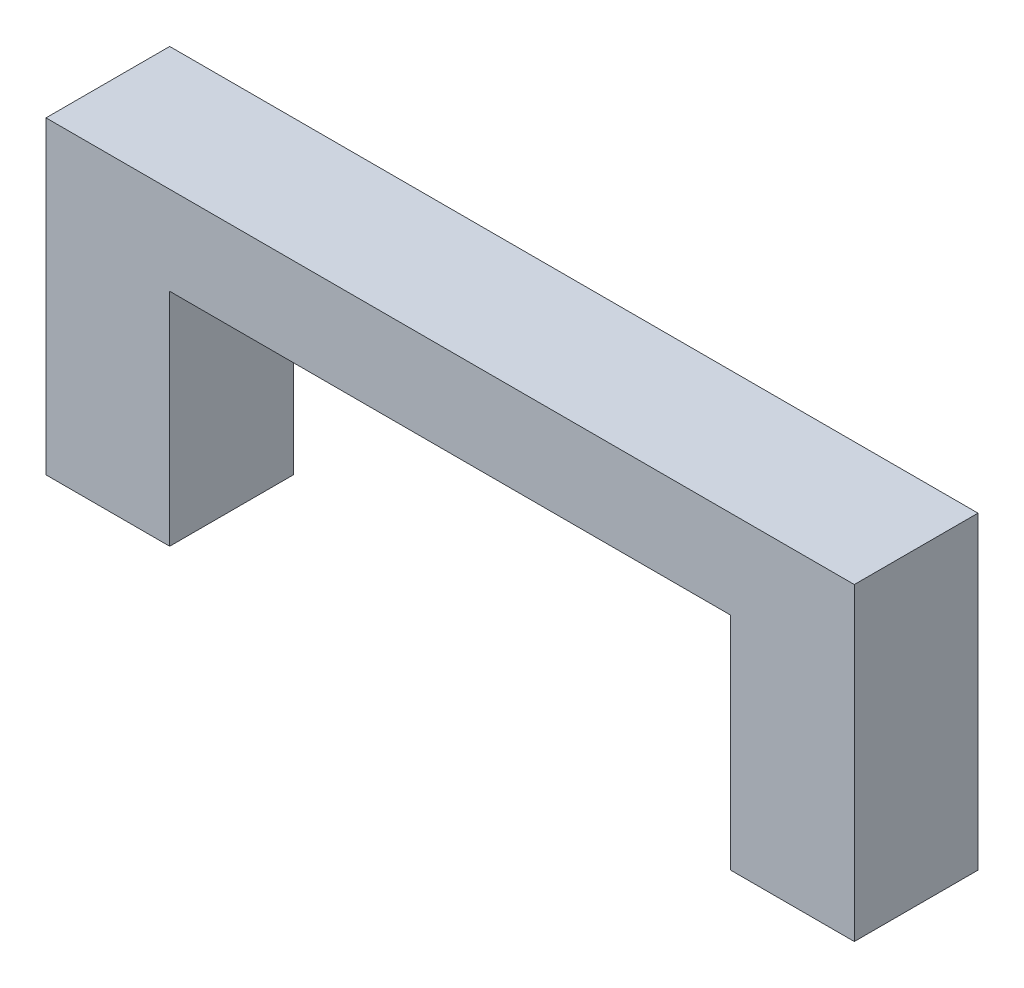
ISO-10303-21;
HEADER;
FILE_DESCRIPTION(('STEP AP214'),'2;1');
FILE_NAME('part.step','',(''),(''),'','','');
FILE_SCHEMA(('AUTOMOTIVE_DESIGN { 1 0 10303 214 1 1 1 1 }'));
ENDSEC;
DATA;
#1=APPLICATION_CONTEXT('core data for automotive mechanical design processes');
#2=APPLICATION_PROTOCOL_DEFINITION('international standard','automotive_design',2000,#1);
#3=PRODUCT_CONTEXT('',#1,'mechanical');
#4=PRODUCT('Part','Part','',(#3));
#5=PRODUCT_RELATED_PRODUCT_CATEGORY('part','',(#4));
#6=PRODUCT_DEFINITION_FORMATION('','',#4);
#7=PRODUCT_DEFINITION_CONTEXT('part definition',#1,'design');
#8=PRODUCT_DEFINITION('design','',#6,#7);
#9=PRODUCT_DEFINITION_SHAPE('','',#8);
#10=(LENGTH_UNIT() NAMED_UNIT(*) SI_UNIT(.MILLI.,.METRE.));
#11=(NAMED_UNIT(*) PLANE_ANGLE_UNIT() SI_UNIT($,.RADIAN.));
#12=(NAMED_UNIT(*) SI_UNIT($,.STERADIAN.) SOLID_ANGLE_UNIT());
#13=UNCERTAINTY_MEASURE_WITH_UNIT(LENGTH_MEASURE(1.E-05),#10,'distance_accuracy_value','');
#14=(GEOMETRIC_REPRESENTATION_CONTEXT(3) GLOBAL_UNCERTAINTY_ASSIGNED_CONTEXT((#13)) GLOBAL_UNIT_ASSIGNED_CONTEXT((#10,
#11,#12)) REPRESENTATION_CONTEXT('',''));
#15=CARTESIAN_POINT('',(0.,0.,0.));
#16=DIRECTION('',(0.,0.,1.));
#17=DIRECTION('',(1.,0.,0.));
#18=AXIS2_PLACEMENT_3D('',#15,#16,#17);
#19=CARTESIAN_POINT('',(18.3,0.,2.8));
#20=DIRECTION('',(0.,1.,0.));
#21=DIRECTION('',(-1.,0.,0.));
#22=AXIS2_PLACEMENT_3D('',#19,#20,#21);
#23=PLANE('',#22);
#24=DIRECTION('',(1.,0.,0.));
#25=VECTOR('',#24,1.);
#26=CARTESIAN_POINT('',(18.3,0.,0.));
#27=LINE('',#26,#25);
#28=CARTESIAN_POINT('',(15.5,0.,0.));
#29=VERTEX_POINT('',#28);
#30=CARTESIAN_POINT('',(18.3,0.,0.));
#31=VERTEX_POINT('',#30);
#32=EDGE_CURVE('E236',#29,#31,#27,.T.);
#33=ORIENTED_EDGE('',*,*,#32,.T.);
#34=DIRECTION('',(0.,0.,-1.));
#35=VECTOR('',#34,1.);
#36=CARTESIAN_POINT('',(18.3,0.,2.8));
#37=LINE('',#36,#35);
#38=CARTESIAN_POINT('',(18.3,0.,2.8));
#39=VERTEX_POINT('',#38);
#40=EDGE_CURVE('E251',#39,#31,#37,.T.);
#41=ORIENTED_EDGE('',*,*,#40,.F.);
#42=DIRECTION('',(1.,0.,0.));
#43=VECTOR('',#42,1.);
#44=CARTESIAN_POINT('',(18.3,0.,2.8));
#45=LINE('',#44,#43);
#46=CARTESIAN_POINT('',(15.5,0.,2.8));
#47=VERTEX_POINT('',#46);
#48=EDGE_CURVE('E219',#47,#39,#45,.T.);
#49=ORIENTED_EDGE('',*,*,#48,.F.);
#50=DIRECTION('',(0.,0.,-1.));
#51=VECTOR('',#50,1.);
#52=CARTESIAN_POINT('',(15.5,0.,2.8));
#53=LINE('',#52,#51);
#54=EDGE_CURVE('E254',#47,#29,#53,.T.);
#55=ORIENTED_EDGE('',*,*,#54,.T.);
#56=EDGE_LOOP('',(#33,#41,#49,#55));
#57=FACE_BOUND('',#56,.T.);
#58=DIRECTION('',(0.,0.,-1.));
#59=VECTOR('',#58,1.);
#60=CARTESIAN_POINT('',(17.9,0.,0.));
#61=LINE('',#60,#59);
#62=CARTESIAN_POINT('',(17.9,0.,2.4));
#63=VERTEX_POINT('',#62);
#64=CARTESIAN_POINT('',(17.9,0.,0.4));
#65=VERTEX_POINT('',#64);
#66=EDGE_CURVE('E56',#63,#65,#61,.T.);
#67=ORIENTED_EDGE('',*,*,#66,.T.);
#68=DIRECTION('',(1.,0.,0.));
#69=VECTOR('',#68,1.);
#70=CARTESIAN_POINT('',(0.,0.,0.4));
#71=LINE('',#70,#69);
#72=CARTESIAN_POINT('',(15.9,0.,0.4));
#73=VERTEX_POINT('',#72);
#74=EDGE_CURVE('E185',#73,#65,#71,.T.);
#75=ORIENTED_EDGE('',*,*,#74,.F.);
#76=DIRECTION('',(0.,0.,-1.));
#77=VECTOR('',#76,1.);
#78=CARTESIAN_POINT('',(15.9,0.,0.));
#79=LINE('',#78,#77);
#80=CARTESIAN_POINT('',(15.9,0.,2.4));
#81=VERTEX_POINT('',#80);
#82=EDGE_CURVE('E196',#81,#73,#79,.T.);
#83=ORIENTED_EDGE('',*,*,#82,.F.);
#84=DIRECTION('',(1.,0.,0.));
#85=VECTOR('',#84,1.);
#86=CARTESIAN_POINT('',(0.,0.,2.4));
#87=LINE('',#86,#85);
#88=EDGE_CURVE('E168',#81,#63,#87,.T.);
#89=ORIENTED_EDGE('',*,*,#88,.T.);
#90=EDGE_LOOP('',(#67,#75,#83,#89));
#91=FACE_BOUND('',#90,.T.);
#92=ADVANCED_FACE('F33',(#57,#91),#23,.F.);
#93=CARTESIAN_POINT('',(2.8,0.,2.8));
#94=DIRECTION('',(0.,1.,0.));
#95=DIRECTION('',(-1.,0.,0.));
#96=AXIS2_PLACEMENT_3D('',#93,#94,#95);
#97=PLANE('',#96);
#98=DIRECTION('',(1.,0.,0.));
#99=VECTOR('',#98,1.);
#100=CARTESIAN_POINT('',(0.4,0.,0.4));
#101=LINE('',#100,#99);
#102=CARTESIAN_POINT('',(0.4,0.,0.4));
#103=VERTEX_POINT('',#102);
#104=CARTESIAN_POINT('',(2.4,0.,0.4));
#105=VERTEX_POINT('',#104);
#106=EDGE_CURVE('E166',#103,#105,#101,.T.);
#107=ORIENTED_EDGE('',*,*,#106,.F.);
#108=DIRECTION('',(0.,0.,-1.));
#109=VECTOR('',#108,1.);
#110=CARTESIAN_POINT('',(0.4,0.,2.4));
#111=LINE('',#110,#109);
#112=CARTESIAN_POINT('',(0.4,0.,2.4));
#113=VERTEX_POINT('',#112);
#114=EDGE_CURVE('E48',#113,#103,#111,.T.);
#115=ORIENTED_EDGE('',*,*,#114,.F.);
#116=DIRECTION('',(1.,0.,0.));
#117=VECTOR('',#116,1.);
#118=CARTESIAN_POINT('',(0.4,0.,2.4));
#119=LINE('',#118,#117);
#120=CARTESIAN_POINT('',(2.4,0.,2.4));
#121=VERTEX_POINT('',#120);
#122=EDGE_CURVE('E155',#113,#121,#119,.T.);
#123=ORIENTED_EDGE('',*,*,#122,.T.);
#124=DIRECTION('',(0.,0.,-1.));
#125=VECTOR('',#124,1.);
#126=CARTESIAN_POINT('',(2.4,0.,2.4));
#127=LINE('',#126,#125);
#128=EDGE_CURVE('E161',#121,#105,#127,.T.);
#129=ORIENTED_EDGE('',*,*,#128,.T.);
#130=EDGE_LOOP('',(#107,#115,#123,#129));
#131=FACE_BOUND('',#130,.T.);
#132=DIRECTION('',(1.,0.,0.));
#133=VECTOR('',#132,1.);
#134=CARTESIAN_POINT('',(2.8,0.,0.));
#135=LINE('',#134,#133);
#136=CARTESIAN_POINT('',(0.,0.,0.));
#137=VERTEX_POINT('',#136);
#138=CARTESIAN_POINT('',(2.8,0.,0.));
#139=VERTEX_POINT('',#138);
#140=EDGE_CURVE('E203',#137,#139,#135,.T.);
#141=ORIENTED_EDGE('',*,*,#140,.T.);
#142=DIRECTION('',(0.,0.,-1.));
#143=VECTOR('',#142,1.);
#144=CARTESIAN_POINT('',(2.8,0.,2.8));
#145=LINE('',#144,#143);
#146=CARTESIAN_POINT('',(2.8,0.,2.8));
#147=VERTEX_POINT('',#146);
#148=EDGE_CURVE('E11',#147,#139,#145,.T.);
#149=ORIENTED_EDGE('',*,*,#148,.F.);
#150=DIRECTION('',(1.,0.,0.));
#151=VECTOR('',#150,1.);
#152=CARTESIAN_POINT('',(2.8,0.,2.8));
#153=LINE('',#152,#151);
#154=CARTESIAN_POINT('',(0.,0.,2.8));
#155=VERTEX_POINT('',#154);
#156=EDGE_CURVE('E209',#155,#147,#153,.T.);
#157=ORIENTED_EDGE('',*,*,#156,.F.);
#158=DIRECTION('',(0.,0.,-1.));
#159=VECTOR('',#158,1.);
#160=CARTESIAN_POINT('',(0.,0.,2.8));
#161=LINE('',#160,#159);
#162=EDGE_CURVE('E227',#155,#137,#161,.T.);
#163=ORIENTED_EDGE('',*,*,#162,.T.);
#164=EDGE_LOOP('',(#141,#149,#157,#163));
#165=FACE_BOUND('',#164,.T.);
#166=ADVANCED_FACE('F35',(#131,#165),#97,.F.);
#167=CARTESIAN_POINT('',(2.8,5.,2.8));
#168=DIRECTION('',(-1.,0.,0.));
#169=DIRECTION('',(0.,-1.,0.));
#170=AXIS2_PLACEMENT_3D('',#167,#168,#169);
#171=PLANE('',#170);
#172=DIRECTION('',(0.,1.,0.));
#173=VECTOR('',#172,1.);
#174=CARTESIAN_POINT('',(2.8,5.,0.));
#175=LINE('',#174,#173);
#176=CARTESIAN_POINT('',(2.8,5.,0.));
#177=VERTEX_POINT('',#176);
#178=EDGE_CURVE('E230',#139,#177,#175,.T.);
#179=ORIENTED_EDGE('',*,*,#178,.T.);
#180=DIRECTION('',(0.,0.,-1.));
#181=VECTOR('',#180,1.);
#182=CARTESIAN_POINT('',(2.8,5.,2.8));
#183=LINE('',#182,#181);
#184=CARTESIAN_POINT('',(2.8,5.,2.8));
#185=VERTEX_POINT('',#184);
#186=EDGE_CURVE('E41',#185,#177,#183,.T.);
#187=ORIENTED_EDGE('',*,*,#186,.F.);
#188=DIRECTION('',(0.,1.,0.));
#189=VECTOR('',#188,1.);
#190=CARTESIAN_POINT('',(2.8,5.,2.8));
#191=LINE('',#190,#189);
#192=EDGE_CURVE('E212',#147,#185,#191,.T.);
#193=ORIENTED_EDGE('',*,*,#192,.F.);
#194=ORIENTED_EDGE('',*,*,#148,.T.);
#195=EDGE_LOOP('',(#179,#187,#193,#194));
#196=FACE_BOUND('',#195,.T.);
#197=ADVANCED_FACE('F287',(#196),#171,.F.);
#198=CARTESIAN_POINT('',(15.5,5.,2.8));
#199=DIRECTION('',(0.,1.,0.));
#200=DIRECTION('',(-1.,0.,0.));
#201=AXIS2_PLACEMENT_3D('',#198,#199,#200);
#202=PLANE('',#201);
#203=DIRECTION('',(1.,0.,0.));
#204=VECTOR('',#203,1.);
#205=CARTESIAN_POINT('',(15.5,5.,0.));
#206=LINE('',#205,#204);
#207=CARTESIAN_POINT('',(15.5,5.,0.));
#208=VERTEX_POINT('',#207);
#209=EDGE_CURVE('E232',#177,#208,#206,.T.);
#210=ORIENTED_EDGE('',*,*,#209,.T.);
#211=DIRECTION('',(0.,0.,-1.));
#212=VECTOR('',#211,1.);
#213=CARTESIAN_POINT('',(15.5,5.,2.8));
#214=LINE('',#213,#212);
#215=CARTESIAN_POINT('',(15.5,5.,2.8));
#216=VERTEX_POINT('',#215);
#217=EDGE_CURVE('E257',#216,#208,#214,.T.);
#218=ORIENTED_EDGE('',*,*,#217,.F.);
#219=DIRECTION('',(1.,0.,0.));
#220=VECTOR('',#219,1.);
#221=CARTESIAN_POINT('',(15.5,5.,2.8));
#222=LINE('',#221,#220);
#223=EDGE_CURVE('E215',#185,#216,#222,.T.);
#224=ORIENTED_EDGE('',*,*,#223,.F.);
#225=ORIENTED_EDGE('',*,*,#186,.T.);
#226=EDGE_LOOP('',(#210,#218,#224,#225));
#227=FACE_BOUND('',#226,.T.);
#228=ADVANCED_FACE('F264',(#227),#202,.F.);
#229=CARTESIAN_POINT('',(15.5,0.,2.8));
#230=DIRECTION('',(1.,0.,0.));
#231=DIRECTION('',(0.,0.,-1.));
#232=AXIS2_PLACEMENT_3D('',#229,#230,#231);
#233=PLANE('',#232);
#234=DIRECTION('',(0.,-1.,0.));
#235=VECTOR('',#234,1.);
#236=CARTESIAN_POINT('',(15.5,0.,0.));
#237=LINE('',#236,#235);
#238=EDGE_CURVE('E234',#208,#29,#237,.T.);
#239=ORIENTED_EDGE('',*,*,#238,.T.);
#240=ORIENTED_EDGE('',*,*,#54,.F.);
#241=DIRECTION('',(0.,-1.,0.));
#242=VECTOR('',#241,1.);
#243=CARTESIAN_POINT('',(15.5,0.,2.8));
#244=LINE('',#243,#242);
#245=EDGE_CURVE('E217',#216,#47,#244,.T.);
#246=ORIENTED_EDGE('',*,*,#245,.F.);
#247=ORIENTED_EDGE('',*,*,#217,.T.);
#248=EDGE_LOOP('',(#239,#240,#246,#247));
#249=FACE_BOUND('',#248,.T.);
#250=ADVANCED_FACE('F275',(#249),#233,.F.);
#251=CARTESIAN_POINT('',(18.3,7.,2.8));
#252=DIRECTION('',(-1.,0.,0.));
#253=DIRECTION('',(0.,0.,1.));
#254=AXIS2_PLACEMENT_3D('',#251,#252,#253);
#255=PLANE('',#254);
#256=DIRECTION('',(0.,1.,0.));
#257=VECTOR('',#256,1.);
#258=CARTESIAN_POINT('',(18.3,7.,0.));
#259=LINE('',#258,#257);
#260=CARTESIAN_POINT('',(18.3,7.,0.));
#261=VERTEX_POINT('',#260);
#262=EDGE_CURVE('E238',#31,#261,#259,.T.);
#263=ORIENTED_EDGE('',*,*,#262,.T.);
#264=DIRECTION('',(0.,0.,-1.));
#265=VECTOR('',#264,1.);
#266=CARTESIAN_POINT('',(18.3,7.,2.8));
#267=LINE('',#266,#265);
#268=CARTESIAN_POINT('',(18.3,7.,2.8));
#269=VERTEX_POINT('',#268);
#270=EDGE_CURVE('E248',#269,#261,#267,.T.);
#271=ORIENTED_EDGE('',*,*,#270,.F.);
#272=DIRECTION('',(0.,1.,0.));
#273=VECTOR('',#272,1.);
#274=CARTESIAN_POINT('',(18.3,7.,2.8));
#275=LINE('',#274,#273);
#276=EDGE_CURVE('E221',#39,#269,#275,.T.);
#277=ORIENTED_EDGE('',*,*,#276,.F.);
#278=ORIENTED_EDGE('',*,*,#40,.T.);
#279=EDGE_LOOP('',(#263,#271,#277,#278));
#280=FACE_BOUND('',#279,.T.);
#281=ADVANCED_FACE('F299',(#280),#255,.F.);
#282=CARTESIAN_POINT('',(0.,7.,2.8));
#283=DIRECTION('',(0.,-1.,0.));
#284=DIRECTION('',(0.,0.,-1.));
#285=AXIS2_PLACEMENT_3D('',#282,#283,#284);
#286=PLANE('',#285);
#287=DIRECTION('',(-1.,0.,0.));
#288=VECTOR('',#287,1.);
#289=CARTESIAN_POINT('',(0.,7.,0.));
#290=LINE('',#289,#288);
#291=CARTESIAN_POINT('',(0.,7.,0.));
#292=VERTEX_POINT('',#291);
#293=EDGE_CURVE('E240',#261,#292,#290,.T.);
#294=ORIENTED_EDGE('',*,*,#293,.T.);
#295=DIRECTION('',(0.,0.,-1.));
#296=VECTOR('',#295,1.);
#297=CARTESIAN_POINT('',(0.,7.,2.8));
#298=LINE('',#297,#296);
#299=CARTESIAN_POINT('',(0.,7.,2.8));
#300=VERTEX_POINT('',#299);
#301=EDGE_CURVE('E245',#300,#292,#298,.T.);
#302=ORIENTED_EDGE('',*,*,#301,.F.);
#303=DIRECTION('',(-1.,0.,0.));
#304=VECTOR('',#303,1.);
#305=CARTESIAN_POINT('',(0.,7.,2.8));
#306=LINE('',#305,#304);
#307=EDGE_CURVE('E223',#269,#300,#306,.T.);
#308=ORIENTED_EDGE('',*,*,#307,.F.);
#309=ORIENTED_EDGE('',*,*,#270,.T.);
#310=EDGE_LOOP('',(#294,#302,#308,#309));
#311=FACE_BOUND('',#310,.T.);
#312=ADVANCED_FACE('F297',(#311),#286,.F.);
#313=CARTESIAN_POINT('',(0.,0.,2.8));
#314=DIRECTION('',(1.,0.,0.));
#315=DIRECTION('',(0.,0.,-1.));
#316=AXIS2_PLACEMENT_3D('',#313,#314,#315);
#317=PLANE('',#316);
#318=DIRECTION('',(0.,-1.,0.));
#319=VECTOR('',#318,1.);
#320=CARTESIAN_POINT('',(0.,0.,0.));
#321=LINE('',#320,#319);
#322=EDGE_CURVE('E213',#292,#137,#321,.T.);
#323=ORIENTED_EDGE('',*,*,#322,.T.);
#324=ORIENTED_EDGE('',*,*,#162,.F.);
#325=DIRECTION('',(0.,-1.,0.));
#326=VECTOR('',#325,1.);
#327=CARTESIAN_POINT('',(0.,0.,2.8));
#328=LINE('',#327,#326);
#329=EDGE_CURVE('E225',#300,#155,#328,.T.);
#330=ORIENTED_EDGE('',*,*,#329,.F.);
#331=ORIENTED_EDGE('',*,*,#301,.T.);
#332=EDGE_LOOP('',(#323,#324,#330,#331));
#333=FACE_BOUND('',#332,.T.);
#334=ADVANCED_FACE('F292',(#333),#317,.F.);
#335=CARTESIAN_POINT('',(0.,0.,2.8));
#336=DIRECTION('',(0.,0.,-1.));
#337=DIRECTION('',(-1.,0.,0.));
#338=AXIS2_PLACEMENT_3D('',#335,#336,#337);
#339=PLANE('',#338);
#340=ORIENTED_EDGE('',*,*,#156,.T.);
#341=ORIENTED_EDGE('',*,*,#192,.T.);
#342=ORIENTED_EDGE('',*,*,#223,.T.);
#343=ORIENTED_EDGE('',*,*,#245,.T.);
#344=ORIENTED_EDGE('',*,*,#48,.T.);
#345=ORIENTED_EDGE('',*,*,#276,.T.);
#346=ORIENTED_EDGE('',*,*,#307,.T.);
#347=ORIENTED_EDGE('',*,*,#329,.T.);
#348=EDGE_LOOP('',(#340,#341,#342,#343,#344,#345,#346,#347));
#349=FACE_BOUND('',#348,.T.);
#350=ADVANCED_FACE('F283',(#349),#339,.F.);
#351=CARTESIAN_POINT('',(0.,0.,0.));
#352=DIRECTION('',(0.,0.,-1.));
#353=DIRECTION('',(-1.,0.,0.));
#354=AXIS2_PLACEMENT_3D('',#351,#352,#353);
#355=PLANE('',#354);
#356=ORIENTED_EDGE('',*,*,#140,.F.);
#357=ORIENTED_EDGE('',*,*,#322,.F.);
#358=ORIENTED_EDGE('',*,*,#293,.F.);
#359=ORIENTED_EDGE('',*,*,#262,.F.);
#360=ORIENTED_EDGE('',*,*,#32,.F.);
#361=ORIENTED_EDGE('',*,*,#238,.F.);
#362=ORIENTED_EDGE('',*,*,#209,.F.);
#363=ORIENTED_EDGE('',*,*,#178,.F.);
#364=EDGE_LOOP('',(#356,#357,#358,#359,#360,#361,#362,#363));
#365=FACE_BOUND('',#364,.T.);
#366=ADVANCED_FACE('F270',(#365),#355,.T.);
#367=CARTESIAN_POINT('',(17.9,2.2,0.));
#368=DIRECTION('',(-1.,0.,0.));
#369=DIRECTION('',(0.,0.,1.));
#370=AXIS2_PLACEMENT_3D('',#367,#368,#369);
#371=PLANE('',#370);
#372=ORIENTED_EDGE('',*,*,#66,.F.);
#373=DIRECTION('',(0.,-1.,0.));
#374=VECTOR('',#373,1.);
#375=CARTESIAN_POINT('',(17.9,2.2,2.4));
#376=LINE('',#375,#374);
#377=CARTESIAN_POINT('',(17.9,2.2,2.4));
#378=VERTEX_POINT('',#377);
#379=EDGE_CURVE('E192',#378,#63,#376,.T.);
#380=ORIENTED_EDGE('',*,*,#379,.F.);
#381=DIRECTION('',(0.,0.,-1.));
#382=VECTOR('',#381,1.);
#383=CARTESIAN_POINT('',(17.9,2.2,0.));
#384=LINE('',#383,#382);
#385=CARTESIAN_POINT('',(17.9,2.2,0.4));
#386=VERTEX_POINT('',#385);
#387=EDGE_CURVE('E182',#378,#386,#384,.T.);
#388=ORIENTED_EDGE('',*,*,#387,.T.);
#389=DIRECTION('',(0.,-1.,0.));
#390=VECTOR('',#389,1.);
#391=CARTESIAN_POINT('',(17.9,2.2,0.4));
#392=LINE('',#391,#390);
#393=EDGE_CURVE('E201',#386,#65,#392,.T.);
#394=ORIENTED_EDGE('',*,*,#393,.T.);
#395=EDGE_LOOP('',(#372,#380,#388,#394));
#396=FACE_BOUND('',#395,.T.);
#397=ADVANCED_FACE('F362',(#396),#371,.T.);
#398=CARTESIAN_POINT('',(0.,2.2,0.4));
#399=DIRECTION('',(0.,0.,-1.));
#400=DIRECTION('',(-1.,0.,0.));
#401=AXIS2_PLACEMENT_3D('',#398,#399,#400);
#402=PLANE('',#401);
#403=ORIENTED_EDGE('',*,*,#74,.T.);
#404=ORIENTED_EDGE('',*,*,#393,.F.);
#405=DIRECTION('',(1.,0.,0.));
#406=VECTOR('',#405,1.);
#407=CARTESIAN_POINT('',(0.,2.2,0.4));
#408=LINE('',#407,#406);
#409=CARTESIAN_POINT('',(15.9,2.2,0.4));
#410=VERTEX_POINT('',#409);
#411=EDGE_CURVE('E190',#410,#386,#408,.T.);
#412=ORIENTED_EDGE('',*,*,#411,.F.);
#413=DIRECTION('',(0.,-1.,0.));
#414=VECTOR('',#413,1.);
#415=CARTESIAN_POINT('',(15.9,2.2,0.4));
#416=LINE('',#415,#414);
#417=EDGE_CURVE('E204',#410,#73,#416,.T.);
#418=ORIENTED_EDGE('',*,*,#417,.T.);
#419=EDGE_LOOP('',(#403,#404,#412,#418));
#420=FACE_BOUND('',#419,.T.);
#421=ADVANCED_FACE('F380',(#420),#402,.F.);
#422=CARTESIAN_POINT('',(15.9,2.2,0.));
#423=DIRECTION('',(-1.,0.,0.));
#424=DIRECTION('',(0.,0.,1.));
#425=AXIS2_PLACEMENT_3D('',#422,#423,#424);
#426=PLANE('',#425);
#427=ORIENTED_EDGE('',*,*,#82,.T.);
#428=ORIENTED_EDGE('',*,*,#417,.F.);
#429=DIRECTION('',(0.,0.,-1.));
#430=VECTOR('',#429,1.);
#431=CARTESIAN_POINT('',(15.9,2.2,0.));
#432=LINE('',#431,#430);
#433=CARTESIAN_POINT('',(15.9,2.2,2.4));
#434=VERTEX_POINT('',#433);
#435=EDGE_CURVE('E187',#434,#410,#432,.T.);
#436=ORIENTED_EDGE('',*,*,#435,.F.);
#437=DIRECTION('',(0.,-1.,0.));
#438=VECTOR('',#437,1.);
#439=CARTESIAN_POINT('',(15.9,2.2,2.4));
#440=LINE('',#439,#438);
#441=EDGE_CURVE('E206',#434,#81,#440,.T.);
#442=ORIENTED_EDGE('',*,*,#441,.T.);
#443=EDGE_LOOP('',(#427,#428,#436,#442));
#444=FACE_BOUND('',#443,.T.);
#445=ADVANCED_FACE('F389',(#444),#426,.F.);
#446=CARTESIAN_POINT('',(0.,2.2,2.4));
#447=DIRECTION('',(0.,0.,-1.));
#448=DIRECTION('',(-1.,0.,0.));
#449=AXIS2_PLACEMENT_3D('',#446,#447,#448);
#450=PLANE('',#449);
#451=ORIENTED_EDGE('',*,*,#88,.F.);
#452=ORIENTED_EDGE('',*,*,#441,.F.);
#453=DIRECTION('',(1.,0.,0.));
#454=VECTOR('',#453,1.);
#455=CARTESIAN_POINT('',(0.,2.2,2.4));
#456=LINE('',#455,#454);
#457=EDGE_CURVE('E184',#434,#378,#456,.T.);
#458=ORIENTED_EDGE('',*,*,#457,.T.);
#459=ORIENTED_EDGE('',*,*,#379,.T.);
#460=EDGE_LOOP('',(#451,#452,#458,#459));
#461=FACE_BOUND('',#460,.T.);
#462=ADVANCED_FACE('F399',(#461),#450,.T.);
#463=CARTESIAN_POINT('',(0.,2.2,0.));
#464=DIRECTION('',(0.,-1.,0.));
#465=DIRECTION('',(0.,0.,-1.));
#466=AXIS2_PLACEMENT_3D('',#463,#464,#465);
#467=PLANE('',#466);
#468=ORIENTED_EDGE('',*,*,#387,.F.);
#469=ORIENTED_EDGE('',*,*,#457,.F.);
#470=ORIENTED_EDGE('',*,*,#435,.T.);
#471=ORIENTED_EDGE('',*,*,#411,.T.);
#472=EDGE_LOOP('',(#468,#469,#470,#471));
#473=FACE_BOUND('',#472,.T.);
#474=ADVANCED_FACE('F409',(#473),#467,.T.);
#475=CARTESIAN_POINT('',(0.4,2.2,2.4));
#476=DIRECTION('',(-1.,0.,0.));
#477=DIRECTION('',(0.,0.,1.));
#478=AXIS2_PLACEMENT_3D('',#475,#476,#477);
#479=PLANE('',#478);
#480=ORIENTED_EDGE('',*,*,#114,.T.);
#481=DIRECTION('',(0.,-1.,0.));
#482=VECTOR('',#481,1.);
#483=CARTESIAN_POINT('',(0.4,2.2,0.4));
#484=LINE('',#483,#482);
#485=CARTESIAN_POINT('',(0.4,2.2,0.4));
#486=VERTEX_POINT('',#485);
#487=EDGE_CURVE('E176',#486,#103,#484,.T.);
#488=ORIENTED_EDGE('',*,*,#487,.F.);
#489=DIRECTION('',(0.,0.,-1.));
#490=VECTOR('',#489,1.);
#491=CARTESIAN_POINT('',(0.4,2.2,2.4));
#492=LINE('',#491,#490);
#493=CARTESIAN_POINT('',(0.4,2.2,2.4));
#494=VERTEX_POINT('',#493);
#495=EDGE_CURVE('E149',#494,#486,#492,.T.);
#496=ORIENTED_EDGE('',*,*,#495,.F.);
#497=DIRECTION('',(0.,-1.,0.));
#498=VECTOR('',#497,1.);
#499=CARTESIAN_POINT('',(0.4,2.2,2.4));
#500=LINE('',#499,#498);
#501=EDGE_CURVE('E145',#494,#113,#500,.T.);
#502=ORIENTED_EDGE('',*,*,#501,.T.);
#503=EDGE_LOOP('',(#480,#488,#496,#502));
#504=FACE_BOUND('',#503,.T.);
#505=ADVANCED_FACE('F147',(#504),#479,.F.);
#506=CARTESIAN_POINT('',(0.4,2.2,2.4));
#507=DIRECTION('',(0.,0.,-1.));
#508=DIRECTION('',(-1.,0.,0.));
#509=AXIS2_PLACEMENT_3D('',#506,#507,#508);
#510=PLANE('',#509);
#511=ORIENTED_EDGE('',*,*,#122,.F.);
#512=ORIENTED_EDGE('',*,*,#501,.F.);
#513=DIRECTION('',(1.,0.,0.));
#514=VECTOR('',#513,1.);
#515=CARTESIAN_POINT('',(0.4,2.2,2.4));
#516=LINE('',#515,#514);
#517=CARTESIAN_POINT('',(2.4,2.2,2.4));
#518=VERTEX_POINT('',#517);
#519=EDGE_CURVE('E173',#494,#518,#516,.T.);
#520=ORIENTED_EDGE('',*,*,#519,.T.);
#521=DIRECTION('',(0.,-1.,0.));
#522=VECTOR('',#521,1.);
#523=CARTESIAN_POINT('',(2.4,2.2,2.4));
#524=LINE('',#523,#522);
#525=EDGE_CURVE('E152',#518,#121,#524,.T.);
#526=ORIENTED_EDGE('',*,*,#525,.T.);
#527=EDGE_LOOP('',(#511,#512,#520,#526));
#528=FACE_BOUND('',#527,.T.);
#529=ADVANCED_FACE('F156',(#528),#510,.T.);
#530=CARTESIAN_POINT('',(2.4,2.2,2.4));
#531=DIRECTION('',(-1.,0.,0.));
#532=DIRECTION('',(0.,0.,1.));
#533=AXIS2_PLACEMENT_3D('',#530,#531,#532);
#534=PLANE('',#533);
#535=ORIENTED_EDGE('',*,*,#128,.F.);
#536=ORIENTED_EDGE('',*,*,#525,.F.);
#537=DIRECTION('',(0.,0.,-1.));
#538=VECTOR('',#537,1.);
#539=CARTESIAN_POINT('',(2.4,2.2,2.4));
#540=LINE('',#539,#538);
#541=CARTESIAN_POINT('',(2.4,2.2,0.4));
#542=VERTEX_POINT('',#541);
#543=EDGE_CURVE('E175',#518,#542,#540,.T.);
#544=ORIENTED_EDGE('',*,*,#543,.T.);
#545=DIRECTION('',(0.,-1.,0.));
#546=VECTOR('',#545,1.);
#547=CARTESIAN_POINT('',(2.4,2.2,0.4));
#548=LINE('',#547,#546);
#549=EDGE_CURVE('E472',#542,#105,#548,.T.);
#550=ORIENTED_EDGE('',*,*,#549,.T.);
#551=EDGE_LOOP('',(#535,#536,#544,#550));
#552=FACE_BOUND('',#551,.T.);
#553=ADVANCED_FACE('F436',(#552),#534,.T.);
#554=CARTESIAN_POINT('',(0.4,2.2,0.4));
#555=DIRECTION('',(0.,0.,-1.));
#556=DIRECTION('',(-1.,0.,0.));
#557=AXIS2_PLACEMENT_3D('',#554,#555,#556);
#558=PLANE('',#557);
#559=ORIENTED_EDGE('',*,*,#106,.T.);
#560=ORIENTED_EDGE('',*,*,#549,.F.);
#561=DIRECTION('',(1.,0.,0.));
#562=VECTOR('',#561,1.);
#563=CARTESIAN_POINT('',(0.4,2.2,0.4));
#564=LINE('',#563,#562);
#565=EDGE_CURVE('E178',#486,#542,#564,.T.);
#566=ORIENTED_EDGE('',*,*,#565,.F.);
#567=ORIENTED_EDGE('',*,*,#487,.T.);
#568=EDGE_LOOP('',(#559,#560,#566,#567));
#569=FACE_BOUND('',#568,.T.);
#570=ADVANCED_FACE('F445',(#569),#558,.F.);
#571=CARTESIAN_POINT('',(0.,2.2,0.));
#572=DIRECTION('',(0.,-1.,0.));
#573=DIRECTION('',(0.,0.,-1.));
#574=AXIS2_PLACEMENT_3D('',#571,#572,#573);
#575=PLANE('',#574);
#576=ORIENTED_EDGE('',*,*,#495,.T.);
#577=ORIENTED_EDGE('',*,*,#565,.T.);
#578=ORIENTED_EDGE('',*,*,#543,.F.);
#579=ORIENTED_EDGE('',*,*,#519,.F.);
#580=EDGE_LOOP('',(#576,#577,#578,#579));
#581=FACE_BOUND('',#580,.T.);
#582=ADVANCED_FACE('F455',(#581),#575,.T.);
#583=CLOSED_SHELL('',(#92,#166,#197,#228,#250,#281,#312,#334,#350,#366,#397,#421,#445,#462,#474,
#505,#529,#553,#570,#582));
#584=MANIFOLD_SOLID_BREP('B2',#583);
#585=ADVANCED_BREP_SHAPE_REPRESENTATION('',(#18,#584),#14);
#586=SHAPE_DEFINITION_REPRESENTATION(#9,#585);
ENDSEC;
END-ISO-10303-21;
